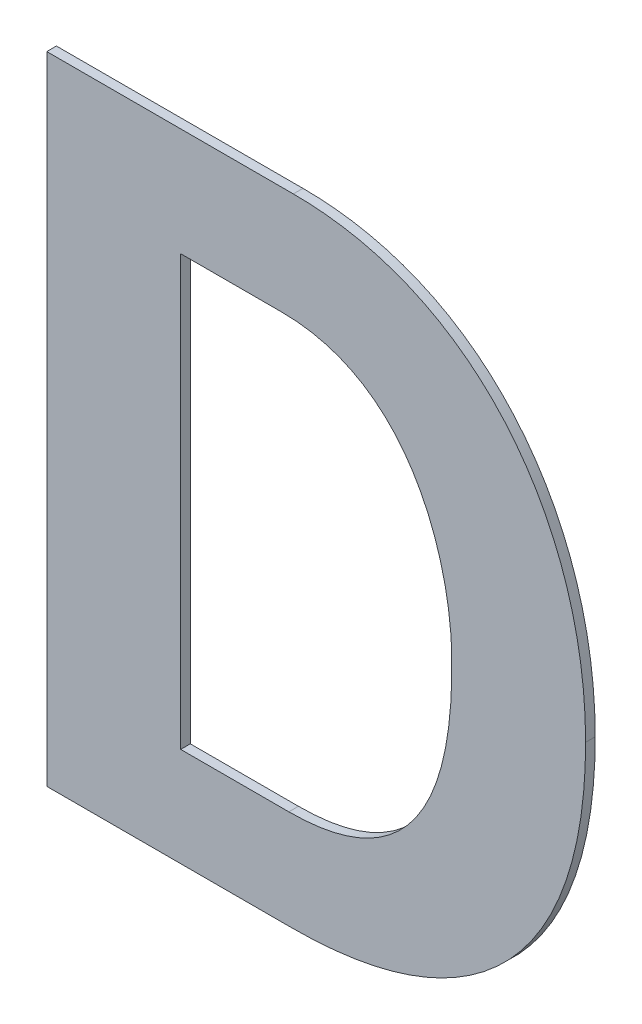
ISO-10303-21;
HEADER;
FILE_DESCRIPTION(('STEP AP214'),'2;1');
FILE_NAME('part.step','',(''),(''),'','','');
FILE_SCHEMA(('AUTOMOTIVE_DESIGN { 1 0 10303 214 1 1 1 1 }'));
ENDSEC;
DATA;
#1=APPLICATION_CONTEXT('core data for automotive mechanical design processes');
#2=APPLICATION_PROTOCOL_DEFINITION('international standard','automotive_design',2000,#1);
#3=PRODUCT_CONTEXT('',#1,'mechanical');
#4=PRODUCT('Part','Part','',(#3));
#5=PRODUCT_RELATED_PRODUCT_CATEGORY('part','',(#4));
#6=PRODUCT_DEFINITION_FORMATION('','',#4);
#7=PRODUCT_DEFINITION_CONTEXT('part definition',#1,'design');
#8=PRODUCT_DEFINITION('design','',#6,#7);
#9=PRODUCT_DEFINITION_SHAPE('','',#8);
#10=(LENGTH_UNIT() NAMED_UNIT(*) SI_UNIT(.MILLI.,.METRE.));
#11=(NAMED_UNIT(*) PLANE_ANGLE_UNIT() SI_UNIT($,.RADIAN.));
#12=(NAMED_UNIT(*) SI_UNIT($,.STERADIAN.) SOLID_ANGLE_UNIT());
#13=UNCERTAINTY_MEASURE_WITH_UNIT(LENGTH_MEASURE(1.E-05),#10,'distance_accuracy_value','');
#14=(GEOMETRIC_REPRESENTATION_CONTEXT(3) GLOBAL_UNCERTAINTY_ASSIGNED_CONTEXT((#13)) GLOBAL_UNIT_ASSIGNED_CONTEXT((#10,
#11,#12)) REPRESENTATION_CONTEXT('',''));
#15=CARTESIAN_POINT('',(0.,0.,0.));
#16=DIRECTION('',(0.,0.,1.));
#17=DIRECTION('',(1.,0.,0.));
#18=AXIS2_PLACEMENT_3D('',#15,#16,#17);
#19=CARTESIAN_POINT('',(2.9385820491674,-0.889901920234014,0.));
#20=CARTESIAN_POINT('',(2.99051697913443,-0.889910668545931,0.));
#21=CARTESIAN_POINT('',(2.9893464210681,-0.822996959924793,0.));
#22=CARTESIAN_POINT('',(2.9385820491674,-0.889901920234014,0.003));
#23=CARTESIAN_POINT('',(2.99051697913443,-0.889910668545931,0.003));
#24=CARTESIAN_POINT('',(2.9893464210681,-0.822996959924793,0.003));
#25=(BOUNDED_SURFACE() B_SPLINE_SURFACE(1,2,((#19,#20,#21),(#22,#23,#24)),.UNSPECIFIED.,.F.,.F.,
.F.) B_SPLINE_SURFACE_WITH_KNOTS((2,2),(3,3),(0.,0.0019491593971049),(-3.26585838225494,
-2.93330212237463),
.UNSPECIFIED.) GEOMETRIC_REPRESENTATION_ITEM() RATIONAL_B_SPLINE_SURFACE(((1.,0.986207613867162,
1.),(1.,0.986207613867162,1.))) REPRESENTATION_ITEM('') SURFACE());
#26=CARTESIAN_POINT('',(2.9893464210681,-0.822996959924794,0.));
#27=CARTESIAN_POINT('',(2.98939241404007,-0.82566594744971,0.));
#28=CARTESIAN_POINT('',(2.98937627422994,-0.828336714881469,0.));
#29=CARTESIAN_POINT('',(2.98923888328536,-0.832279205445989,0.));
#30=CARTESIAN_POINT('',(2.98917692401192,-0.833553193065629,0.));
#31=CARTESIAN_POINT('',(2.98901717725813,-0.836060254410106,0.));
#32=CARTESIAN_POINT('',(2.98892053163074,-0.837293398764178,0.));
#33=CARTESIAN_POINT('',(2.98869125968837,-0.839718403943163,0.));
#34=CARTESIAN_POINT('',(2.98855982132388,-0.840910376268337,0.));
#35=CARTESIAN_POINT('',(2.98826088820991,-0.843252739915907,0.));
#36=CARTESIAN_POINT('',(2.98809462110442,-0.844403286615384,0.));
#37=CARTESIAN_POINT('',(2.9877259551842,-0.846662492879888,0.));
#38=CARTESIAN_POINT('',(2.98752481759256,-0.847771356922665,0.));
#39=CARTESIAN_POINT('',(2.9870863580319,-0.8499469041934,0.));
#40=CARTESIAN_POINT('',(2.98685032174441,-0.851013845058156,0.));
#41=CARTESIAN_POINT('',(2.98634203224942,-0.853105260291143,0.));
#42=CARTESIAN_POINT('',(2.98607107745903,-0.854130048631172,0.));
#43=CARTESIAN_POINT('',(2.98549294297258,-0.856136883608557,0.));
#44=CARTESIAN_POINT('',(2.98518705963888,-0.857119302021029,0.));
#45=CARTESIAN_POINT('',(2.98453908701849,-0.859041134714421,0.));
#46=CARTESIAN_POINT('',(2.98419827413802,-0.85998097758776,0.));
#47=CARTESIAN_POINT('',(2.9834804935253,-0.861817410035652,0.));
#48=CARTESIAN_POINT('',(2.98310476129387,-0.862714480774955,0.));
#49=CARTESIAN_POINT('',(2.98231722172344,-0.86446514528643,0.));
#50=CARTESIAN_POINT('',(2.98190658571042,-0.865319264094646,0.));
#51=CARTESIAN_POINT('',(2.98104937289746,-0.866983800495633,0.));
#52=CARTESIAN_POINT('',(2.98060387785963,-0.86779477401734,0.));
#53=CARTESIAN_POINT('',(2.97967705268888,-0.869372910842872,0.));
#54=CARTESIAN_POINT('',(2.97919669121427,-0.870140639920551,0.));
#55=CARTESIAN_POINT('',(2.9784461212709,-0.871264232095376,0.));
#56=CARTESIAN_POINT('',(2.97819288106722,-0.87163151508849,0.));
#57=CARTESIAN_POINT('',(2.97767763942833,-0.872355147698425,0.));
#58=CARTESIAN_POINT('',(2.97741573220757,-0.872711564226622,0.));
#59=CARTESIAN_POINT('',(2.97688318436186,-0.873413436732293,0.));
#60=CARTESIAN_POINT('',(2.97661262787065,-0.87375895655084,0.));
#61=CARTESIAN_POINT('',(2.9760628009508,-0.874439029194125,0.));
#62=CARTESIAN_POINT('',(2.9757836042622,-0.87477364160412,0.));
#63=CARTESIAN_POINT('',(2.97521652000386,-0.875431889931445,0.));
#64=CARTESIAN_POINT('',(2.9749286954957,-0.875755580159311,0.));
#65=CARTESIAN_POINT('',(2.97434437891872,-0.876391977891816,0.));
#66=CARTESIAN_POINT('',(2.9740479391094,-0.876704733364337,0.));
#67=CARTESIAN_POINT('',(2.97344641621498,-0.877319256953017,0.));
#68=CARTESIAN_POINT('',(2.97314137460538,-0.877621065657415,0.));
#69=CARTESIAN_POINT('',(2.97252267298212,-0.878213693090646,0.));
#70=CARTESIAN_POINT('',(2.97220904383113,-0.878504544033998,0.));
#71=CARTESIAN_POINT('',(2.97157319248619,-0.87907525517066,0.));
#72=CARTESIAN_POINT('',(2.97125099086479,-0.87935513828173,0.));
#73=CARTESIAN_POINT('',(2.97059802025817,-0.879903914778343,0.));
#74=CARTESIAN_POINT('',(2.9702672620249,-0.880172820956434,0.));
#75=CARTESIAN_POINT('',(2.9695972040467,-0.880699646301345,0.));
#76=CARTESIAN_POINT('',(2.96925790583939,-0.880957567423822,0.));
#77=CARTESIAN_POINT('',(2.96857079380034,-0.881462426941131,0.));
#78=CARTESIAN_POINT('',(2.96822297302021,-0.881709355878628,0.));
#79=CARTESIAN_POINT('',(2.96751884163434,-0.882192236738588,0.));
#80=CARTESIAN_POINT('',(2.96716251642595,-0.882428167364889,0.));
#81=CARTESIAN_POINT('',(2.96644140180149,-0.882889058588267,0.));
#82=CARTESIAN_POINT('',(2.96607659104202,-0.883113985784609,0.));
#83=CARTESIAN_POINT('',(2.9653385306397,-0.883552878252685,0.));
#84=CARTESIAN_POINT('',(2.96496525388401,-0.883766797918076,0.));
#85=CARTESIAN_POINT('',(2.96421028659327,-0.884183684352643,0.));
#86=CARTESIAN_POINT('',(2.96382856418098,-0.884386593372645,0.));
#87=CARTESIAN_POINT('',(2.96305672995239,-0.884781468417049,0.));
#88=CARTESIAN_POINT('',(2.96266658250577,-0.884973364770869,0.));
#89=CARTESIAN_POINT('',(2.96187792365315,-0.885346224680291,0.));
#90=CARTESIAN_POINT('',(2.96147937387157,-0.885527107010364,0.));
#91=CARTESIAN_POINT('',(2.96067393008968,-0.885877950803182,0.));
#92=CARTESIAN_POINT('',(2.9602669958935,-0.886047819996173,0.));
#93=CARTESIAN_POINT('',(2.95944482297571,-0.886376645087044,0.));
#94=CARTESIAN_POINT('',(2.95902954330976,-0.886535498250859,0.));
#95=CARTESIAN_POINT('',(2.95776523605213,-0.886997904537827,0.));
#96=CARTESIAN_POINT('',(2.95690914469519,-0.887282349509584,0.));
#97=CARTESIAN_POINT('',(2.95516421486134,-0.88780815815005,0.));
#98=CARTESIAN_POINT('',(2.95427506663481,-0.888048484963086,0.));
#99=CARTESIAN_POINT('',(2.95246412473776,-0.88848625208853,0.));
#100=CARTESIAN_POINT('',(2.95154205552334,-0.888682548361314,0.));
#101=CARTESIAN_POINT('',(2.94966546357531,-0.889032394150542,0.));
#102=CARTESIAN_POINT('',(2.94871071447048,-0.889184720163237,0.));
#103=CARTESIAN_POINT('',(2.94676891797573,-0.889446758013234,0.));
#104=CARTESIAN_POINT('',(2.94578169987994,-0.889555194313239,0.));
#105=CARTESIAN_POINT('',(2.94377516803799,-0.88972958717842,0.));
#106=CARTESIAN_POINT('',(2.94275574333952,-0.889794241169337,0.));
#107=CARTESIAN_POINT('',(2.94068486604807,-0.889881127356238,0.));
#108=CARTESIAN_POINT('',(2.9396333574245,-0.889902049156185,0.));
#109=CARTESIAN_POINT('',(2.9385820491674,-0.889901920234014,0.));
#110=B_SPLINE_CURVE_WITH_KNOTS('',3,(#26,#27,#28,#29,#30,#31,#32,#33,#34,#35,#36,#37,#38,#39,
#40,#41,#42,#43,#44,#45,#46,#47,#48,#49,#50,#51,#52,#53,#54,#55,#56,#57,#58,#59,#60,#61,#62,#63,
#64,#65,#66,#67,#68,#69,#70,#71,#72,#73,#74,#75,#76,#77,#78,#79,#80,#81,#82,#83,#84,#85,#86,#87,
#88,#89,#90,#91,#92,#93,#94,#95,#96,#97,#98,#99,#100,#101,#102,#103,#104,#105,#106,#107,#108,
#109),.UNSPECIFIED.,.F.,.F.,(4,2,2,2,2,2,2,2,2,2,2,2,2,2,2,2,2,2,2,2,2,2,2,2,2,2,2,2,2,2,2,2,2,
2,2,2,2,2,2,2,2,4),(0.,0.00800783679654212,0.0118338816332566,0.0155440578110772,
0.0191410173632574,0.022627808418136,0.0260079106764694,0.0292852722692542,0.0324643470494898,
0.0355501309369004,0.0385481954181623,0.0414647157337063,0.0443064907128457,0.0470809507467372,
0.0497961501474755,0.0511343572261696,0.052461041626093,0.0537773697382396,0.055084537806707,
0.0563837690984452,0.0576763107194898,0.0589634301041698,0.0602464112136876,0.0615265504897915,
0.0628051526174956,0.0640835261574581,0.0653629791133228,0.0666448145016971,0.0679303259924286,
0.0692207936843438,0.070517480076884,0.0718216262913199,0.0731344485869471,0.0744571352082872,
0.0757908435893423,0.078495503200965,0.0812572901630307,0.084084156777598,0.0869834201995946,
0.0899617562739914,0.0930252089648868,0.0961792115895133),.UNSPECIFIED.);
#111=CARTESIAN_POINT('',(2.9893464210681,-0.822996959924794,0.));
#112=VERTEX_POINT('',#111);
#113=CARTESIAN_POINT('',(2.9385820491674,-0.889901920234014,0.));
#114=VERTEX_POINT('',#113);
#115=EDGE_CURVE('E11',#112,#114,#110,.T.);
#116=DIRECTION('',(0.,0.,1.));
#117=VECTOR('',#116,1.);
#118=CARTESIAN_POINT('',(2.9385820491674,-0.889901920234014,0.));
#119=LINE('',#118,#117);
#120=CARTESIAN_POINT('',(2.9385820491674,-0.889901920234014,0.003));
#121=VERTEX_POINT('',#120);
#122=EDGE_CURVE('E27',#114,#121,#119,.T.);
#123=CARTESIAN_POINT('',(2.9385820491674,-0.889901920234014,0.003));
#124=CARTESIAN_POINT('',(2.99051697913443,-0.889910668545931,0.003));
#125=CARTESIAN_POINT('',(2.9893464210681,-0.822996959924793,0.003));
#126=(BOUNDED_CURVE() B_SPLINE_CURVE(2,(#123,#124,#125),.UNSPECIFIED.,.F.,
.F.) B_SPLINE_CURVE_WITH_KNOTS((3,3),(-3.26585838225494,-2.93330212237463),
.UNSPECIFIED.) CURVE() GEOMETRIC_REPRESENTATION_ITEM() RATIONAL_B_SPLINE_CURVE((1.,
0.986207613867162,1.)) REPRESENTATION_ITEM(''));
#127=CARTESIAN_POINT('',(2.9893464210681,-0.822996959924794,0.003));
#128=VERTEX_POINT('',#127);
#129=EDGE_CURVE('E222',#128,#121,#126,.F.);
#130=DIRECTION('',(0.,0.,1.));
#131=VECTOR('',#130,1.);
#132=CARTESIAN_POINT('',(2.9893464210681,-0.822996959924794,0.));
#133=LINE('',#132,#131);
#134=EDGE_CURVE('E217',#112,#128,#133,.T.);
#135=ORIENTED_EDGE('',*,*,#115,.T.);
#136=ORIENTED_EDGE('',*,*,#122,.T.);
#137=ORIENTED_EDGE('',*,*,#129,.F.);
#138=ORIENTED_EDGE('',*,*,#134,.F.);
#139=EDGE_LOOP('',(#135,#136,#137,#138));
#140=FACE_BOUND('',#139,.T.);
#141=ADVANCED_FACE('F17',(#140),#25,.T.);
#142=CARTESIAN_POINT('',(2.9361996570168,-0.75609199961562,0.));
#143=CARTESIAN_POINT('',(2.9361996570168,-0.75609199961562,0.003));
#144=CARTESIAN_POINT('',(2.9784309645434,-0.756092004053329,0.));
#145=CARTESIAN_POINT('',(2.9784309645434,-0.756092004053329,0.003));
#146=CARTESIAN_POINT('',(2.9893464118037,-0.800210302599535,0.));
#147=CARTESIAN_POINT('',(2.9893464118037,-0.800210302599535,0.003));
#148=CARTESIAN_POINT('',(2.9893464210681,-0.822996959924794,0.));
#149=CARTESIAN_POINT('',(2.9893464210681,-0.822996959924794,0.003));
#150=B_SPLINE_SURFACE_WITH_KNOTS('',3,1,((#142,#143),(#144,#145),(#146,#147),(#148,#149)),
.UNSPECIFIED.,.F.,.F.,.F.,(4,4),(2,2),(0.,1.),(0.,0.0003),.UNSPECIFIED.);
#151=CARTESIAN_POINT('',(2.9361996570168,-0.75609199961562,0.));
#152=CARTESIAN_POINT('',(2.9784309645434,-0.756092004053329,0.));
#153=CARTESIAN_POINT('',(2.9893464118037,-0.800210302599535,0.));
#154=CARTESIAN_POINT('',(2.9893464210681,-0.822996959924794,0.));
#155=B_SPLINE_CURVE_WITH_KNOTS('',3,(#151,#152,#153,#154),.UNSPECIFIED.,.F.,.F.,(4,4),(0.,1.),.UNSPECIFIED.);
#156=CARTESIAN_POINT('',(2.9361996570168,-0.75609199961562,0.));
#157=VERTEX_POINT('',#156);
#158=EDGE_CURVE('E207',#157,#112,#155,.T.);
#159=CARTESIAN_POINT('',(2.9361996570168,-0.75609199961562,0.003));
#160=CARTESIAN_POINT('',(2.9784309645434,-0.756092004053329,0.003));
#161=CARTESIAN_POINT('',(2.9893464118037,-0.800210302599535,0.003));
#162=CARTESIAN_POINT('',(2.9893464210681,-0.822996959924794,0.003));
#163=B_SPLINE_CURVE_WITH_KNOTS('',3,(#159,#160,#161,#162),.UNSPECIFIED.,.F.,.F.,(4,4),(0.,1.),.UNSPECIFIED.);
#164=CARTESIAN_POINT('',(2.9361996570168,-0.75609199961562,0.003));
#165=VERTEX_POINT('',#164);
#166=EDGE_CURVE('E197',#165,#128,#163,.T.);
#167=DIRECTION('',(0.,0.,1.));
#168=VECTOR('',#167,1.);
#169=CARTESIAN_POINT('',(2.9361996570168,-0.75609199961562,0.));
#170=LINE('',#169,#168);
#171=EDGE_CURVE('E194',#157,#165,#170,.T.);
#172=ORIENTED_EDGE('',*,*,#158,.T.);
#173=ORIENTED_EDGE('',*,*,#134,.T.);
#174=ORIENTED_EDGE('',*,*,#166,.F.);
#175=ORIENTED_EDGE('',*,*,#171,.F.);
#176=EDGE_LOOP('',(#172,#173,#174,#175));
#177=FACE_BOUND('',#176,.T.);
#178=ADVANCED_FACE('F289',(#177),#150,.T.);
#179=CARTESIAN_POINT('',(2.9048761734259,-0.75609199961562,0.));
#180=DIRECTION('',(0.,-1.,0.));
#181=DIRECTION('',(1.,0.,0.));
#182=AXIS2_PLACEMENT_3D('',#179,#180,#181);
#183=PLANE('',#182);
#184=DIRECTION('',(1.,0.,0.));
#185=VECTOR('',#184,1.);
#186=CARTESIAN_POINT('',(2.9048761734259,-0.75609199961562,0.));
#187=LINE('',#186,#185);
#188=CARTESIAN_POINT('',(2.9048761734259,-0.75609199961562,0.));
#189=VERTEX_POINT('',#188);
#190=EDGE_CURVE('E191',#189,#157,#187,.T.);
#191=ORIENTED_EDGE('',*,*,#190,.T.);
#192=ORIENTED_EDGE('',*,*,#171,.T.);
#193=DIRECTION('',(1.,0.,0.));
#194=VECTOR('',#193,1.);
#195=CARTESIAN_POINT('',(2.9048761734259,-0.75609199961562,0.003));
#196=LINE('',#195,#194);
#197=CARTESIAN_POINT('',(2.9048761734259,-0.75609199961562,0.003));
#198=VERTEX_POINT('',#197);
#199=EDGE_CURVE('E188',#198,#165,#196,.T.);
#200=ORIENTED_EDGE('',*,*,#199,.F.);
#201=DIRECTION('',(0.,0.,1.));
#202=VECTOR('',#201,1.);
#203=CARTESIAN_POINT('',(2.9048761734259,-0.75609199961562,0.));
#204=LINE('',#203,#202);
#205=EDGE_CURVE('E185',#189,#198,#204,.T.);
#206=ORIENTED_EDGE('',*,*,#205,.F.);
#207=EDGE_LOOP('',(#191,#192,#200,#206));
#208=FACE_BOUND('',#207,.T.);
#209=ADVANCED_FACE('F286',(#208),#183,.T.);
#210=CARTESIAN_POINT('',(2.9048761734259,-0.889901920234014,0.));
#211=DIRECTION('',(1.,0.,0.));
#212=DIRECTION('',(0.,1.,0.));
#213=AXIS2_PLACEMENT_3D('',#210,#211,#212);
#214=PLANE('',#213);
#215=DIRECTION('',(0.,1.,0.));
#216=VECTOR('',#215,1.);
#217=CARTESIAN_POINT('',(2.9048761734259,-0.889901920234014,0.));
#218=LINE('',#217,#216);
#219=CARTESIAN_POINT('',(2.9048761734259,-0.889901920234014,0.));
#220=VERTEX_POINT('',#219);
#221=EDGE_CURVE('E182',#220,#189,#218,.T.);
#222=ORIENTED_EDGE('',*,*,#221,.T.);
#223=ORIENTED_EDGE('',*,*,#205,.T.);
#224=DIRECTION('',(0.,1.,0.));
#225=VECTOR('',#224,1.);
#226=CARTESIAN_POINT('',(2.9048761734259,-0.889901920234014,0.003));
#227=LINE('',#226,#225);
#228=CARTESIAN_POINT('',(2.9048761734259,-0.889901920234014,0.003));
#229=VERTEX_POINT('',#228);
#230=EDGE_CURVE('E179',#229,#198,#227,.T.);
#231=ORIENTED_EDGE('',*,*,#230,.F.);
#232=DIRECTION('',(0.,0.,1.));
#233=VECTOR('',#232,1.);
#234=CARTESIAN_POINT('',(2.9048761734259,-0.889901920234014,0.));
#235=LINE('',#234,#233);
#236=EDGE_CURVE('E176',#220,#229,#235,.T.);
#237=ORIENTED_EDGE('',*,*,#236,.F.);
#238=EDGE_LOOP('',(#222,#223,#231,#237));
#239=FACE_BOUND('',#238,.T.);
#240=ADVANCED_FACE('F282',(#239),#214,.T.);
#241=CARTESIAN_POINT('',(2.9385820491674,-0.889901920234014,0.));
#242=DIRECTION('',(0.,1.,0.));
#243=DIRECTION('',(-1.,0.,0.));
#244=AXIS2_PLACEMENT_3D('',#241,#242,#243);
#245=PLANE('',#244);
#246=DIRECTION('',(-1.,0.,0.));
#247=VECTOR('',#246,1.);
#248=CARTESIAN_POINT('',(2.9385820491674,-0.889901920234014,0.));
#249=LINE('',#248,#247);
#250=EDGE_CURVE('E171',#114,#220,#249,.T.);
#251=ORIENTED_EDGE('',*,*,#250,.T.);
#252=ORIENTED_EDGE('',*,*,#236,.T.);
#253=DIRECTION('',(-1.,0.,0.));
#254=VECTOR('',#253,1.);
#255=CARTESIAN_POINT('',(2.9385820491674,-0.889901920234014,0.003));
#256=LINE('',#255,#254);
#257=EDGE_CURVE('E166',#121,#229,#256,.T.);
#258=ORIENTED_EDGE('',*,*,#257,.F.);
#259=ORIENTED_EDGE('',*,*,#122,.F.);
#260=EDGE_LOOP('',(#251,#252,#258,#259));
#261=FACE_BOUND('',#260,.T.);
#262=ADVANCED_FACE('F278',(#261),#245,.T.);
#263=CARTESIAN_POINT('',(2.9399849608072,-0.722389912967327,0.));
#264=DIRECTION('',(0.,1.,0.));
#265=DIRECTION('',(-1.,0.,0.));
#266=AXIS2_PLACEMENT_3D('',#263,#264,#265);
#267=PLANE('',#266);
#268=DIRECTION('',(-1.,0.,0.));
#269=VECTOR('',#268,1.);
#270=CARTESIAN_POINT('',(2.9399849608072,-0.722389912967327,0.));
#271=LINE('',#270,#269);
#272=CARTESIAN_POINT('',(2.9399849608072,-0.722389912967327,0.));
#273=VERTEX_POINT('',#272);
#274=CARTESIAN_POINT('',(2.863126053494,-0.722389912967327,0.));
#275=VERTEX_POINT('',#274);
#276=EDGE_CURVE('E164',#273,#275,#271,.T.);
#277=ORIENTED_EDGE('',*,*,#276,.T.);
#278=DIRECTION('',(0.,0.,1.));
#279=VECTOR('',#278,1.);
#280=CARTESIAN_POINT('',(2.863126053494,-0.722389912967327,0.));
#281=LINE('',#280,#279);
#282=CARTESIAN_POINT('',(2.863126053494,-0.722389912967327,0.003));
#283=VERTEX_POINT('',#282);
#284=EDGE_CURVE('E162',#275,#283,#281,.T.);
#285=ORIENTED_EDGE('',*,*,#284,.T.);
#286=DIRECTION('',(-1.,0.,0.));
#287=VECTOR('',#286,1.);
#288=CARTESIAN_POINT('',(2.9399849608072,-0.722389912967327,0.003));
#289=LINE('',#288,#287);
#290=CARTESIAN_POINT('',(2.9399849608072,-0.722389912967327,0.003));
#291=VERTEX_POINT('',#290);
#292=EDGE_CURVE('E119',#291,#283,#289,.T.);
#293=ORIENTED_EDGE('',*,*,#292,.F.);
#294=DIRECTION('',(0.,0.,1.));
#295=VECTOR('',#294,1.);
#296=CARTESIAN_POINT('',(2.9399849608072,-0.722389912967327,0.));
#297=LINE('',#296,#295);
#298=EDGE_CURVE('E155',#273,#291,#297,.T.);
#299=ORIENTED_EDGE('',*,*,#298,.F.);
#300=EDGE_LOOP('',(#277,#285,#293,#299));
#301=FACE_BOUND('',#300,.T.);
#302=ADVANCED_FACE('F269',(#301),#267,.T.);
#303=CARTESIAN_POINT('',(3.0310965409999,-0.824880139087665,0.));
#304=CARTESIAN_POINT('',(3.0310965409999,-0.824880139087665,0.003));
#305=CARTESIAN_POINT('',(3.0310965436868,-0.767466851019691,0.));
#306=CARTESIAN_POINT('',(3.0310965436868,-0.767466851019691,0.003));
#307=CARTESIAN_POINT('',(2.9969359741126,-0.722389909572824,0.));
#308=CARTESIAN_POINT('',(2.9969359741126,-0.722389909572824,0.003));
#309=CARTESIAN_POINT('',(2.9399849608072,-0.722389912967327,0.));
#310=CARTESIAN_POINT('',(2.9399849608072,-0.722389912967327,0.003));
#311=B_SPLINE_SURFACE_WITH_KNOTS('',3,1,((#303,#304),(#305,#306),(#307,#308),(#309,#310)),
.UNSPECIFIED.,.F.,.F.,.F.,(4,4),(2,2),(0.,1.),(0.,0.0003),.UNSPECIFIED.);
#312=CARTESIAN_POINT('',(3.0310965409999,-0.824880139087665,0.));
#313=CARTESIAN_POINT('',(3.0310965436868,-0.767466851019691,0.));
#314=CARTESIAN_POINT('',(2.9969359741126,-0.722389909572824,0.));
#315=CARTESIAN_POINT('',(2.9399849608072,-0.722389912967327,0.));
#316=B_SPLINE_CURVE_WITH_KNOTS('',3,(#312,#313,#314,#315),.UNSPECIFIED.,.F.,.F.,(4,4),(0.,1.),.UNSPECIFIED.);
#317=CARTESIAN_POINT('',(3.0310965409999,-0.824880139087665,0.));
#318=VERTEX_POINT('',#317);
#319=EDGE_CURVE('E147',#318,#273,#316,.T.);
#320=CARTESIAN_POINT('',(3.0310965409999,-0.824880139087665,0.003));
#321=CARTESIAN_POINT('',(3.0310965436868,-0.767466851019691,0.003));
#322=CARTESIAN_POINT('',(2.9969359741126,-0.722389909572824,0.003));
#323=CARTESIAN_POINT('',(2.9399849608072,-0.722389912967327,0.003));
#324=B_SPLINE_CURVE_WITH_KNOTS('',3,(#320,#321,#322,#323),.UNSPECIFIED.,.F.,.F.,(4,4),(0.,1.),.UNSPECIFIED.);
#325=CARTESIAN_POINT('',(3.0310965409999,-0.824880139087665,0.003));
#326=VERTEX_POINT('',#325);
#327=EDGE_CURVE('E143',#326,#291,#324,.T.);
#328=DIRECTION('',(0.,0.,1.));
#329=VECTOR('',#328,1.);
#330=CARTESIAN_POINT('',(3.0310965409999,-0.824880139087665,0.));
#331=LINE('',#330,#329);
#332=EDGE_CURVE('E137',#318,#326,#331,.T.);
#333=ORIENTED_EDGE('',*,*,#319,.T.);
#334=ORIENTED_EDGE('',*,*,#298,.T.);
#335=ORIENTED_EDGE('',*,*,#327,.F.);
#336=ORIENTED_EDGE('',*,*,#332,.F.);
#337=EDGE_LOOP('',(#333,#334,#335,#336));
#338=FACE_BOUND('',#337,.T.);
#339=ADVANCED_FACE('F258',(#338),#311,.T.);
#340=CARTESIAN_POINT('',(2.9395226914757,-0.920762187220293,0.));
#341=CARTESIAN_POINT('',(2.9395226914757,-0.920762187220293,0.003));
#342=CARTESIAN_POINT('',(3.0007402300202,-0.920762189326914,0.));
#343=CARTESIAN_POINT('',(3.0007402300202,-0.920762189326914,0.003));
#344=CARTESIAN_POINT('',(3.0310965449853,-0.882312367189599,0.));
#345=CARTESIAN_POINT('',(3.0310965449853,-0.882312367189599,0.003));
#346=CARTESIAN_POINT('',(3.0310965409999,-0.824880139087665,0.));
#347=CARTESIAN_POINT('',(3.0310965409999,-0.824880139087665,0.003));
#348=B_SPLINE_SURFACE_WITH_KNOTS('',3,1,((#340,#341),(#342,#343),(#344,#345),(#346,#347)),
.UNSPECIFIED.,.F.,.F.,.F.,(4,4),(2,2),(0.,1.),(0.,0.0003),.UNSPECIFIED.);
#349=CARTESIAN_POINT('',(2.9395226914757,-0.920762187220293,0.));
#350=CARTESIAN_POINT('',(3.0007402300202,-0.920762189326914,0.));
#351=CARTESIAN_POINT('',(3.0310965449853,-0.882312367189599,0.));
#352=CARTESIAN_POINT('',(3.0310965409999,-0.824880139087665,0.));
#353=B_SPLINE_CURVE_WITH_KNOTS('',3,(#349,#350,#351,#352),.UNSPECIFIED.,.F.,.F.,(4,4),(0.,1.),.UNSPECIFIED.);
#354=CARTESIAN_POINT('',(2.9395226914757,-0.920762187220293,0.));
#355=VERTEX_POINT('',#354);
#356=EDGE_CURVE('E129',#355,#318,#353,.T.);
#357=CARTESIAN_POINT('',(2.9395226914757,-0.920762187220293,0.003));
#358=CARTESIAN_POINT('',(3.0007402300202,-0.920762189326914,0.003));
#359=CARTESIAN_POINT('',(3.0310965449853,-0.882312367189599,0.003));
#360=CARTESIAN_POINT('',(3.0310965409999,-0.824880139087665,0.003));
#361=B_SPLINE_CURVE_WITH_KNOTS('',3,(#357,#358,#359,#360),.UNSPECIFIED.,.F.,.F.,(4,4),(0.,1.),.UNSPECIFIED.);
#362=CARTESIAN_POINT('',(2.9395226914757,-0.920762187220293,0.003));
#363=VERTEX_POINT('',#362);
#364=EDGE_CURVE('E125',#363,#326,#361,.T.);
#365=DIRECTION('',(0.,0.,1.));
#366=VECTOR('',#365,1.);
#367=CARTESIAN_POINT('',(2.9395226914757,-0.920762187220293,0.));
#368=LINE('',#367,#366);
#369=EDGE_CURVE('E101',#355,#363,#368,.T.);
#370=ORIENTED_EDGE('',*,*,#356,.T.);
#371=ORIENTED_EDGE('',*,*,#332,.T.);
#372=ORIENTED_EDGE('',*,*,#364,.F.);
#373=ORIENTED_EDGE('',*,*,#369,.F.);
#374=EDGE_LOOP('',(#370,#371,#372,#373));
#375=FACE_BOUND('',#374,.T.);
#376=ADVANCED_FACE('F253',(#375),#348,.T.);
#377=CARTESIAN_POINT('',(2.863126053494,-0.920762187220293,0.));
#378=DIRECTION('',(0.,-1.,0.));
#379=DIRECTION('',(1.,0.,0.));
#380=AXIS2_PLACEMENT_3D('',#377,#378,#379);
#381=PLANE('',#380);
#382=DIRECTION('',(1.,0.,0.));
#383=VECTOR('',#382,1.);
#384=CARTESIAN_POINT('',(2.863126053494,-0.920762187220293,0.));
#385=LINE('',#384,#383);
#386=CARTESIAN_POINT('',(2.863126053494,-0.920762187220293,0.));
#387=VERTEX_POINT('',#386);
#388=EDGE_CURVE('E105',#387,#355,#385,.T.);
#389=ORIENTED_EDGE('',*,*,#388,.T.);
#390=ORIENTED_EDGE('',*,*,#369,.T.);
#391=DIRECTION('',(1.,0.,0.));
#392=VECTOR('',#391,1.);
#393=CARTESIAN_POINT('',(2.863126053494,-0.920762187220293,0.003));
#394=LINE('',#393,#392);
#395=CARTESIAN_POINT('',(2.863126053494,-0.920762187220293,0.003));
#396=VERTEX_POINT('',#395);
#397=EDGE_CURVE('E94',#396,#363,#394,.T.);
#398=ORIENTED_EDGE('',*,*,#397,.F.);
#399=DIRECTION('',(0.,0.,1.));
#400=VECTOR('',#399,1.);
#401=CARTESIAN_POINT('',(2.863126053494,-0.920762187220293,0.));
#402=LINE('',#401,#400);
#403=EDGE_CURVE('E98',#387,#396,#402,.T.);
#404=ORIENTED_EDGE('',*,*,#403,.F.);
#405=EDGE_LOOP('',(#389,#390,#398,#404));
#406=FACE_BOUND('',#405,.T.);
#407=ADVANCED_FACE('F97',(#406),#381,.T.);
#408=CARTESIAN_POINT('',(2.863126053494,-0.722389912967327,0.));
#409=DIRECTION('',(-1.,0.,0.));
#410=DIRECTION('',(0.,-1.,0.));
#411=AXIS2_PLACEMENT_3D('',#408,#409,#410);
#412=PLANE('',#411);
#413=DIRECTION('',(0.,-1.,0.));
#414=VECTOR('',#413,1.);
#415=CARTESIAN_POINT('',(2.863126053494,-0.722389912967327,0.));
#416=LINE('',#415,#414);
#417=EDGE_CURVE('E113',#275,#387,#416,.T.);
#418=ORIENTED_EDGE('',*,*,#417,.T.);
#419=ORIENTED_EDGE('',*,*,#403,.T.);
#420=DIRECTION('',(0.,-1.,0.));
#421=VECTOR('',#420,1.);
#422=CARTESIAN_POINT('',(2.863126053494,-0.722389912967327,0.003));
#423=LINE('',#422,#421);
#424=EDGE_CURVE('E111',#283,#396,#423,.T.);
#425=ORIENTED_EDGE('',*,*,#424,.F.);
#426=ORIENTED_EDGE('',*,*,#284,.F.);
#427=EDGE_LOOP('',(#418,#419,#425,#426));
#428=FACE_BOUND('',#427,.T.);
#429=ADVANCED_FACE('F109',(#428),#412,.T.);
#430=CARTESIAN_POINT('',(2.9471112992397,-0.821576049449869,0.003));
#431=DIRECTION('',(0.,0.,1.));
#432=DIRECTION('',(1.,0.,0.));
#433=AXIS2_PLACEMENT_3D('',#430,#431,#432);
#434=PLANE('',#433);
#435=ORIENTED_EDGE('',*,*,#424,.T.);
#436=ORIENTED_EDGE('',*,*,#397,.T.);
#437=ORIENTED_EDGE('',*,*,#364,.T.);
#438=ORIENTED_EDGE('',*,*,#327,.T.);
#439=ORIENTED_EDGE('',*,*,#292,.T.);
#440=EDGE_LOOP('',(#435,#436,#437,#438,#439));
#441=FACE_BOUND('',#440,.T.);
#442=ORIENTED_EDGE('',*,*,#257,.T.);
#443=ORIENTED_EDGE('',*,*,#230,.T.);
#444=ORIENTED_EDGE('',*,*,#199,.T.);
#445=ORIENTED_EDGE('',*,*,#166,.T.);
#446=ORIENTED_EDGE('',*,*,#129,.T.);
#447=EDGE_LOOP('',(#442,#443,#444,#445,#446));
#448=FACE_BOUND('',#447,.T.);
#449=ADVANCED_FACE('F116',(#441,#448),#434,.T.);
#450=CARTESIAN_POINT('',(2.9471112992397,-0.821576049449869,0.));
#451=DIRECTION('',(0.,0.,1.));
#452=DIRECTION('',(1.,0.,0.));
#453=AXIS2_PLACEMENT_3D('',#450,#451,#452);
#454=PLANE('',#453);
#455=ORIENTED_EDGE('',*,*,#417,.F.);
#456=ORIENTED_EDGE('',*,*,#276,.F.);
#457=ORIENTED_EDGE('',*,*,#319,.F.);
#458=ORIENTED_EDGE('',*,*,#356,.F.);
#459=ORIENTED_EDGE('',*,*,#388,.F.);
#460=EDGE_LOOP('',(#455,#456,#457,#458,#459));
#461=FACE_BOUND('',#460,.T.);
#462=ORIENTED_EDGE('',*,*,#250,.F.);
#463=ORIENTED_EDGE('',*,*,#115,.F.);
#464=ORIENTED_EDGE('',*,*,#158,.F.);
#465=ORIENTED_EDGE('',*,*,#190,.F.);
#466=ORIENTED_EDGE('',*,*,#221,.F.);
#467=EDGE_LOOP('',(#462,#463,#464,#465,#466));
#468=FACE_BOUND('',#467,.T.);
#469=ADVANCED_FACE('F247',(#461,#468),#454,.F.);
#470=CLOSED_SHELL('',(#141,#178,#209,#240,#262,#302,#339,#376,#407,#429,#449,#469));
#471=MANIFOLD_SOLID_BREP('B1',#470);
#472=ADVANCED_BREP_SHAPE_REPRESENTATION('',(#18,#471),#14);
#473=SHAPE_DEFINITION_REPRESENTATION(#9,#472);
ENDSEC;
END-ISO-10303-21;
